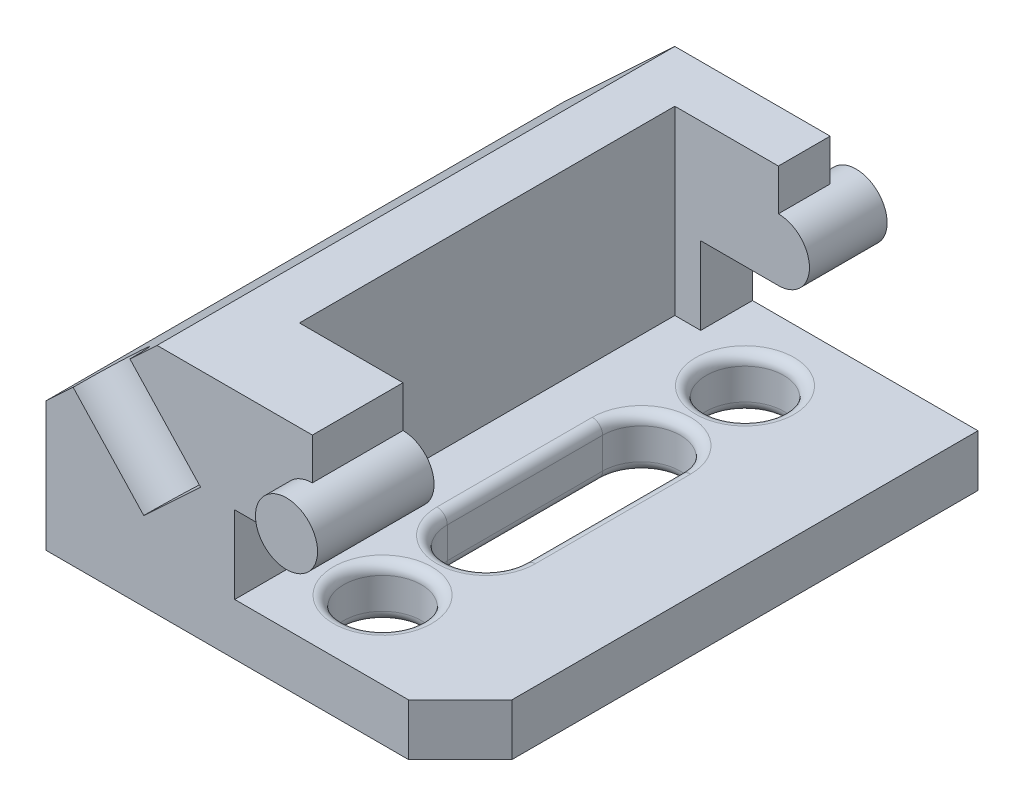
ISO-10303-21;
HEADER;
FILE_DESCRIPTION(('STEP AP214'),'2;1');
FILE_NAME('part.step','',(''),(''),'','','');
FILE_SCHEMA(('AUTOMOTIVE_DESIGN { 1 0 10303 214 1 1 1 1 }'));
ENDSEC;
DATA;
#1=APPLICATION_CONTEXT('core data for automotive mechanical design processes');
#2=APPLICATION_PROTOCOL_DEFINITION('international standard','automotive_design',2000,#1);
#3=PRODUCT_CONTEXT('',#1,'mechanical');
#4=PRODUCT('Part','Part','',(#3));
#5=PRODUCT_RELATED_PRODUCT_CATEGORY('part','',(#4));
#6=PRODUCT_DEFINITION_FORMATION('','',#4);
#7=PRODUCT_DEFINITION_CONTEXT('part definition',#1,'design');
#8=PRODUCT_DEFINITION('design','',#6,#7);
#9=PRODUCT_DEFINITION_SHAPE('','',#8);
#10=(LENGTH_UNIT() NAMED_UNIT(*) SI_UNIT(.MILLI.,.METRE.));
#11=(NAMED_UNIT(*) PLANE_ANGLE_UNIT() SI_UNIT($,.RADIAN.));
#12=(NAMED_UNIT(*) SI_UNIT($,.STERADIAN.) SOLID_ANGLE_UNIT());
#13=UNCERTAINTY_MEASURE_WITH_UNIT(LENGTH_MEASURE(1.E-05),#10,'distance_accuracy_value','');
#14=(GEOMETRIC_REPRESENTATION_CONTEXT(3) GLOBAL_UNCERTAINTY_ASSIGNED_CONTEXT((#13)) GLOBAL_UNIT_ASSIGNED_CONTEXT((#10,
#11,#12)) REPRESENTATION_CONTEXT('',''));
#15=CARTESIAN_POINT('',(0.,0.,0.));
#16=DIRECTION('',(0.,0.,1.));
#17=DIRECTION('',(1.,0.,0.));
#18=AXIS2_PLACEMENT_3D('',#15,#16,#17);
#19=CARTESIAN_POINT('',(36.4473742004937,9.99999999999999,100.));
#20=DIRECTION('',(-1.,0.,0.));
#21=DIRECTION('',(0.,0.,1.));
#22=AXIS2_PLACEMENT_3D('',#19,#20,#21);
#23=PLANE('',#22);
#24=DIRECTION('',(0.,0.,-1.));
#25=VECTOR('',#24,1.);
#26=CARTESIAN_POINT('',(36.4473742004937,9.99999999999999,100.));
#27=LINE('',#26,#25);
#28=CARTESIAN_POINT('',(36.4473742004937,9.99999999999999,100.));
#29=VERTEX_POINT('',#28);
#30=CARTESIAN_POINT('',(36.4473742004937,9.99999999999998,82.5));
#31=VERTEX_POINT('',#30);
#32=EDGE_CURVE('E299',#29,#31,#27,.T.);
#33=ORIENTED_EDGE('',*,*,#32,.T.);
#34=DIRECTION('',(0.,1.,0.));
#35=VECTOR('',#34,1.);
#36=CARTESIAN_POINT('',(36.4473742004937,9.99999999999999,82.5));
#37=LINE('',#36,#35);
#38=CARTESIAN_POINT('',(36.4473742004937,25.,82.5));
#39=VERTEX_POINT('',#38);
#40=EDGE_CURVE('E477',#31,#39,#37,.T.);
#41=ORIENTED_EDGE('',*,*,#40,.T.);
#42=DIRECTION('',(0.,0.,-1.));
#43=VECTOR('',#42,1.);
#44=CARTESIAN_POINT('',(36.4473742004937,25.,100.));
#45=LINE('',#44,#43);
#46=CARTESIAN_POINT('',(36.4473742004937,25.,100.));
#47=VERTEX_POINT('',#46);
#48=EDGE_CURVE('E295',#47,#39,#45,.T.);
#49=ORIENTED_EDGE('',*,*,#48,.F.);
#50=DIRECTION('',(0.,1.,0.));
#51=VECTOR('',#50,1.);
#52=CARTESIAN_POINT('',(36.4473742004937,9.99999999999999,100.));
#53=LINE('',#52,#51);
#54=EDGE_CURVE('E494',#29,#47,#53,.T.);
#55=ORIENTED_EDGE('',*,*,#54,.F.);
#56=EDGE_LOOP('',(#33,#41,#49,#55));
#57=FACE_BOUND('',#56,.T.);
#58=ADVANCED_FACE('F39',(#57),#23,.F.);
#59=CARTESIAN_POINT('',(36.4473742004937,25.,100.));
#60=DIRECTION('',(0.,1.,0.));
#61=DIRECTION('',(0.,0.,1.));
#62=AXIS2_PLACEMENT_3D('',#59,#60,#61);
#63=PLANE('',#62);
#64=ORIENTED_EDGE('',*,*,#48,.T.);
#65=DIRECTION('',(1.,0.,0.));
#66=VECTOR('',#65,1.);
#67=CARTESIAN_POINT('',(36.4473742004937,25.,82.5));
#68=LINE('',#67,#66);
#69=CARTESIAN_POINT('',(51.4473742004937,25.,82.5));
#70=VERTEX_POINT('',#69);
#71=EDGE_CURVE('E474',#39,#70,#68,.T.);
#72=ORIENTED_EDGE('',*,*,#71,.T.);
#73=DIRECTION('',(0.,0.,-1.));
#74=VECTOR('',#73,1.);
#75=CARTESIAN_POINT('',(51.4473742004937,25.,100.));
#76=LINE('',#75,#74);
#77=CARTESIAN_POINT('',(51.4473742004937,25.,100.));
#78=VERTEX_POINT('',#77);
#79=EDGE_CURVE('E291',#78,#70,#76,.T.);
#80=ORIENTED_EDGE('',*,*,#79,.F.);
#81=DIRECTION('',(1.,0.,0.));
#82=VECTOR('',#81,1.);
#83=CARTESIAN_POINT('',(36.4473742004937,25.,100.));
#84=LINE('',#83,#82);
#85=EDGE_CURVE('E496',#47,#78,#84,.T.);
#86=ORIENTED_EDGE('',*,*,#85,.F.);
#87=EDGE_LOOP('',(#64,#72,#80,#86));
#88=FACE_BOUND('',#87,.T.);
#89=ADVANCED_FACE('F566',(#88),#63,.F.);
#90=CARTESIAN_POINT('',(51.4473742004937,31.,100.));
#91=DIRECTION('',(0.,0.,-1.));
#92=DIRECTION('',(-1.,0.,0.));
#93=AXIS2_PLACEMENT_3D('',#90,#91,#92);
#94=CYLINDRICAL_SURFACE('',#93,6.);
#95=CARTESIAN_POINT('',(51.4473742004937,31.,105.));
#96=DIRECTION('',(0.,0.,1.));
#97=DIRECTION('',(1.,0.,0.));
#98=AXIS2_PLACEMENT_3D('',#95,#96,#97);
#99=CIRCLE('',#98,5.99999999999999);
#100=CARTESIAN_POINT('',(57.4473742004937,31.,105.));
#101=VERTEX_POINT('',#100);
#102=EDGE_CURVE('E480',#101,#101,#99,.T.);
#103=ORIENTED_EDGE('',*,*,#102,.F.);
#104=EDGE_LOOP('',(#103));
#105=FACE_BOUND('',#104,.T.);
#106=CARTESIAN_POINT('',(51.4473742004937,31.,82.5));
#107=DIRECTION('',(0.,0.,1.));
#108=DIRECTION('',(1.,0.,0.));
#109=AXIS2_PLACEMENT_3D('',#106,#107,#108);
#110=CIRCLE('',#109,6.);
#111=CARTESIAN_POINT('',(51.4473742004937,37.,82.5));
#112=VERTEX_POINT('',#111);
#113=EDGE_CURVE('E472',#70,#112,#110,.T.);
#114=ORIENTED_EDGE('',*,*,#113,.T.);
#115=DIRECTION('',(0.,0.,-1.));
#116=VECTOR('',#115,1.);
#117=CARTESIAN_POINT('',(51.4473742004937,37.,100.));
#118=LINE('',#117,#116);
#119=CARTESIAN_POINT('',(51.4473742004937,37.,100.));
#120=VERTEX_POINT('',#119);
#121=EDGE_CURVE('E287',#120,#112,#118,.T.);
#122=ORIENTED_EDGE('',*,*,#121,.F.);
#123=CARTESIAN_POINT('',(51.4473742004937,31.,100.));
#124=DIRECTION('',(0.,0.,1.));
#125=DIRECTION('',(1.,0.,0.));
#126=AXIS2_PLACEMENT_3D('',#123,#124,#125);
#127=CIRCLE('',#126,5.99999999999999);
#128=EDGE_CURVE('E255',#120,#78,#127,.T.);
#129=ORIENTED_EDGE('',*,*,#128,.T.);
#130=ORIENTED_EDGE('',*,*,#79,.T.);
#131=EDGE_LOOP('',(#114,#122,#129,#130));
#132=FACE_BOUND('',#131,.T.);
#133=ADVANCED_FACE('F568',(#105,#132),#94,.T.);
#134=CARTESIAN_POINT('',(51.4473742004937,37.,100.));
#135=DIRECTION('',(-1.,0.,0.));
#136=DIRECTION('',(0.,0.,1.));
#137=AXIS2_PLACEMENT_3D('',#134,#135,#136);
#138=PLANE('',#137);
#139=ORIENTED_EDGE('',*,*,#121,.T.);
#140=DIRECTION('',(0.,1.,0.));
#141=VECTOR('',#140,1.);
#142=CARTESIAN_POINT('',(51.4473742004937,37.,82.5));
#143=LINE('',#142,#141);
#144=CARTESIAN_POINT('',(51.4473742004937,45.,82.5));
#145=VERTEX_POINT('',#144);
#146=EDGE_CURVE('E469',#112,#145,#143,.T.);
#147=ORIENTED_EDGE('',*,*,#146,.T.);
#148=DIRECTION('',(0.,0.,-1.));
#149=VECTOR('',#148,1.);
#150=CARTESIAN_POINT('',(51.4473742004937,45.,100.));
#151=LINE('',#150,#149);
#152=CARTESIAN_POINT('',(51.4473742004937,45.,100.));
#153=VERTEX_POINT('',#152);
#154=EDGE_CURVE('E283',#153,#145,#151,.T.);
#155=ORIENTED_EDGE('',*,*,#154,.F.);
#156=DIRECTION('',(0.,1.,0.));
#157=VECTOR('',#156,1.);
#158=CARTESIAN_POINT('',(51.4473742004937,37.,100.));
#159=LINE('',#158,#157);
#160=EDGE_CURVE('E247',#120,#153,#159,.T.);
#161=ORIENTED_EDGE('',*,*,#160,.F.);
#162=EDGE_LOOP('',(#139,#147,#155,#161));
#163=FACE_BOUND('',#162,.T.);
#164=ADVANCED_FACE('F503',(#163),#138,.F.);
#165=CARTESIAN_POINT('',(0.,25.,100.));
#166=DIRECTION('',(1.,0.,0.));
#167=DIRECTION('',(0.,1.,0.));
#168=AXIS2_PLACEMENT_3D('',#165,#166,#167);
#169=PLANE('',#168);
#170=DIRECTION('',(0.,-1.,0.));
#171=VECTOR('',#170,1.);
#172=CARTESIAN_POINT('',(0.,25.,0.));
#173=LINE('',#172,#171);
#174=CARTESIAN_POINT('',(0.,25.,0.));
#175=VERTEX_POINT('',#174);
#176=CARTESIAN_POINT('',(0.,0.,0.));
#177=VERTEX_POINT('',#176);
#178=EDGE_CURVE('E251',#175,#177,#173,.T.);
#179=ORIENTED_EDGE('',*,*,#178,.T.);
#180=DIRECTION('',(0.,0.,-1.));
#181=VECTOR('',#180,1.);
#182=CARTESIAN_POINT('',(0.,0.,100.));
#183=LINE('',#182,#181);
#184=CARTESIAN_POINT('',(0.,0.,100.));
#185=VERTEX_POINT('',#184);
#186=EDGE_CURVE('E306',#185,#177,#183,.T.);
#187=ORIENTED_EDGE('',*,*,#186,.F.);
#188=DIRECTION('',(0.,-1.,0.));
#189=VECTOR('',#188,1.);
#190=CARTESIAN_POINT('',(0.,25.,100.));
#191=LINE('',#190,#189);
#192=CARTESIAN_POINT('',(0.,25.,100.));
#193=VERTEX_POINT('',#192);
#194=EDGE_CURVE('E277',#193,#185,#191,.T.);
#195=ORIENTED_EDGE('',*,*,#194,.F.);
#196=DIRECTION('',(0.,0.,-1.));
#197=VECTOR('',#196,1.);
#198=CARTESIAN_POINT('',(0.,25.,100.));
#199=LINE('',#198,#197);
#200=EDGE_CURVE('E242',#193,#175,#199,.T.);
#201=ORIENTED_EDGE('',*,*,#200,.T.);
#202=EDGE_LOOP('',(#179,#187,#195,#201));
#203=FACE_BOUND('',#202,.T.);
#204=ADVANCED_FACE('F517',(#203),#169,.F.);
#205=CARTESIAN_POINT('',(0.,0.,100.));
#206=DIRECTION('',(0.,1.,0.));
#207=DIRECTION('',(0.,0.,1.));
#208=AXIS2_PLACEMENT_3D('',#205,#206,#207);
#209=PLANE('',#208);
#210=DIRECTION('',(0.,0.,-1.));
#211=VECTOR('',#210,1.);
#212=CARTESIAN_POINT('',(59.5,0.,100.));
#213=LINE('',#212,#211);
#214=CARTESIAN_POINT('',(59.5,0.,65.));
#215=VERTEX_POINT('',#214);
#216=CARTESIAN_POINT('',(59.5,0.,35.));
#217=VERTEX_POINT('',#216);
#218=EDGE_CURVE('E334',#215,#217,#213,.T.);
#219=ORIENTED_EDGE('',*,*,#218,.T.);
#220=CARTESIAN_POINT('',(50.,0.,35.));
#221=DIRECTION('',(0.,1.,0.));
#222=DIRECTION('',(0.,0.,1.));
#223=AXIS2_PLACEMENT_3D('',#220,#221,#222);
#224=CIRCLE('',#223,9.5);
#225=CARTESIAN_POINT('',(40.5,0.,35.));
#226=VERTEX_POINT('',#225);
#227=EDGE_CURVE('E336',#217,#226,#224,.T.);
#228=ORIENTED_EDGE('',*,*,#227,.T.);
#229=DIRECTION('',(0.,0.,1.));
#230=VECTOR('',#229,1.);
#231=CARTESIAN_POINT('',(40.5,0.,100.));
#232=LINE('',#231,#230);
#233=CARTESIAN_POINT('',(40.5,0.,65.));
#234=VERTEX_POINT('',#233);
#235=EDGE_CURVE('E330',#226,#234,#232,.T.);
#236=ORIENTED_EDGE('',*,*,#235,.T.);
#237=CARTESIAN_POINT('',(50.,0.,65.));
#238=DIRECTION('',(0.,1.,0.));
#239=DIRECTION('',(0.,0.,1.));
#240=AXIS2_PLACEMENT_3D('',#237,#238,#239);
#241=CIRCLE('',#240,9.5);
#242=EDGE_CURVE('E332',#234,#215,#241,.T.);
#243=ORIENTED_EDGE('',*,*,#242,.T.);
#244=EDGE_LOOP('',(#219,#228,#236,#243));
#245=FACE_BOUND('',#244,.T.);
#246=CARTESIAN_POINT('',(50.,0.,85.));
#247=DIRECTION('',(0.,1.,0.));
#248=DIRECTION('',(0.,0.,1.));
#249=AXIS2_PLACEMENT_3D('',#246,#247,#248);
#250=CIRCLE('',#249,9.50000000000002);
#251=CARTESIAN_POINT('',(50.,0.,94.5));
#252=VERTEX_POINT('',#251);
#253=EDGE_CURVE('E327',#252,#252,#250,.T.);
#254=ORIENTED_EDGE('',*,*,#253,.T.);
#255=EDGE_LOOP('',(#254));
#256=FACE_BOUND('',#255,.T.);
#257=CARTESIAN_POINT('',(50.,0.,15.));
#258=DIRECTION('',(0.,1.,0.));
#259=DIRECTION('',(0.,0.,1.));
#260=AXIS2_PLACEMENT_3D('',#257,#258,#259);
#261=CIRCLE('',#260,9.5);
#262=CARTESIAN_POINT('',(50.,0.,24.5));
#263=VERTEX_POINT('',#262);
#264=EDGE_CURVE('E324',#263,#263,#261,.T.);
#265=ORIENTED_EDGE('',*,*,#264,.T.);
#266=EDGE_LOOP('',(#265));
#267=FACE_BOUND('',#266,.T.);
#268=DIRECTION('',(0.,0.,-1.));
#269=VECTOR('',#268,1.);
#270=CARTESIAN_POINT('',(80.,0.,100.));
#271=LINE('',#270,#269);
#272=CARTESIAN_POINT('',(80.,0.,90.));
#273=VERTEX_POINT('',#272);
#274=CARTESIAN_POINT('',(80.,0.,0.));
#275=VERTEX_POINT('',#274);
#276=EDGE_CURVE('E304',#273,#275,#271,.T.);
#277=ORIENTED_EDGE('',*,*,#276,.F.);
#278=DIRECTION('',(-0.707106781186545,0.,0.707106781186549));
#279=VECTOR('',#278,1.);
#280=CARTESIAN_POINT('',(70.,0.,100.));
#281=LINE('',#280,#279);
#282=CARTESIAN_POINT('',(70.,0.,100.));
#283=VERTEX_POINT('',#282);
#284=EDGE_CURVE('E316',#273,#283,#281,.T.);
#285=ORIENTED_EDGE('',*,*,#284,.T.);
#286=DIRECTION('',(1.,0.,0.));
#287=VECTOR('',#286,1.);
#288=CARTESIAN_POINT('',(0.,0.,100.));
#289=LINE('',#288,#287);
#290=EDGE_CURVE('E489',#185,#283,#289,.T.);
#291=ORIENTED_EDGE('',*,*,#290,.F.);
#292=ORIENTED_EDGE('',*,*,#186,.T.);
#293=DIRECTION('',(1.,0.,0.));
#294=VECTOR('',#293,1.);
#295=CARTESIAN_POINT('',(0.,0.,0.));
#296=LINE('',#295,#294);
#297=EDGE_CURVE('E254',#177,#275,#296,.T.);
#298=ORIENTED_EDGE('',*,*,#297,.T.);
#299=EDGE_LOOP('',(#277,#285,#291,#292,#298));
#300=FACE_BOUND('',#299,.T.);
#301=ADVANCED_FACE('F596',(#245,#256,#267,#300),#209,.F.);
#302=CARTESIAN_POINT('',(80.,0.,100.));
#303=DIRECTION('',(-1.,0.,0.));
#304=DIRECTION('',(0.,0.,1.));
#305=AXIS2_PLACEMENT_3D('',#302,#303,#304);
#306=PLANE('',#305);
#307=DIRECTION('',(0.,0.,-1.));
#308=VECTOR('',#307,1.);
#309=CARTESIAN_POINT('',(80.,10.,100.));
#310=LINE('',#309,#308);
#311=CARTESIAN_POINT('',(80.,10.,90.));
#312=VERTEX_POINT('',#311);
#313=CARTESIAN_POINT('',(80.,10.,0.));
#314=VERTEX_POINT('',#313);
#315=EDGE_CURVE('E302',#312,#314,#310,.T.);
#316=ORIENTED_EDGE('',*,*,#315,.F.);
#317=DIRECTION('',(0.,-1.,0.));
#318=VECTOR('',#317,1.);
#319=CARTESIAN_POINT('',(80.,0.,90.));
#320=LINE('',#319,#318);
#321=EDGE_CURVE('E314',#312,#273,#320,.T.);
#322=ORIENTED_EDGE('',*,*,#321,.T.);
#323=ORIENTED_EDGE('',*,*,#276,.T.);
#324=DIRECTION('',(0.,1.,0.));
#325=VECTOR('',#324,1.);
#326=CARTESIAN_POINT('',(80.,0.,0.));
#327=LINE('',#326,#325);
#328=EDGE_CURVE('E258',#275,#314,#327,.T.);
#329=ORIENTED_EDGE('',*,*,#328,.T.);
#330=EDGE_LOOP('',(#316,#322,#323,#329));
#331=FACE_BOUND('',#330,.T.);
#332=ADVANCED_FACE('F529',(#331),#306,.F.);
#333=CARTESIAN_POINT('',(80.,10.,100.));
#334=DIRECTION('',(0.,-1.,0.));
#335=DIRECTION('',(1.,0.,0.));
#336=AXIS2_PLACEMENT_3D('',#333,#334,#335);
#337=PLANE('',#336);
#338=DIRECTION('',(0.,0.,1.));
#339=VECTOR('',#338,1.);
#340=CARTESIAN_POINT('',(40.5,9.99999999999999,100.));
#341=LINE('',#340,#339);
#342=CARTESIAN_POINT('',(40.5,9.99999999999999,65.));
#343=VERTEX_POINT('',#342);
#344=CARTESIAN_POINT('',(40.5,9.99999999999999,35.));
#345=VERTEX_POINT('',#344);
#346=EDGE_CURVE('E351',#343,#345,#341,.F.);
#347=ORIENTED_EDGE('',*,*,#346,.T.);
#348=CARTESIAN_POINT('',(50.,9.99999999999999,35.));
#349=DIRECTION('',(0.,-1.,0.));
#350=DIRECTION('',(1.,0.,0.));
#351=AXIS2_PLACEMENT_3D('',#348,#349,#350);
#352=CIRCLE('',#351,9.5);
#353=CARTESIAN_POINT('',(59.5,10.,35.));
#354=VERTEX_POINT('',#353);
#355=EDGE_CURVE('E357',#345,#354,#352,.T.);
#356=ORIENTED_EDGE('',*,*,#355,.T.);
#357=DIRECTION('',(0.,0.,-1.));
#358=VECTOR('',#357,1.);
#359=CARTESIAN_POINT('',(59.5,10.,100.));
#360=LINE('',#359,#358);
#361=CARTESIAN_POINT('',(59.5,10.,65.));
#362=VERTEX_POINT('',#361);
#363=EDGE_CURVE('E355',#354,#362,#360,.F.);
#364=ORIENTED_EDGE('',*,*,#363,.T.);
#365=CARTESIAN_POINT('',(50.,9.99999999999999,65.));
#366=DIRECTION('',(0.,-1.,0.));
#367=DIRECTION('',(1.,0.,0.));
#368=AXIS2_PLACEMENT_3D('',#365,#366,#367);
#369=CIRCLE('',#368,9.5);
#370=EDGE_CURVE('E353',#362,#343,#369,.T.);
#371=ORIENTED_EDGE('',*,*,#370,.T.);
#372=EDGE_LOOP('',(#347,#356,#364,#371));
#373=FACE_BOUND('',#372,.T.);
#374=CARTESIAN_POINT('',(50.,9.99999999999999,85.));
#375=DIRECTION('',(0.,-1.,0.));
#376=DIRECTION('',(1.,0.,0.));
#377=AXIS2_PLACEMENT_3D('',#374,#375,#376);
#378=CIRCLE('',#377,9.50000000000002);
#379=CARTESIAN_POINT('',(59.5,10.,85.));
#380=VERTEX_POINT('',#379);
#381=EDGE_CURVE('E348',#380,#380,#378,.T.);
#382=ORIENTED_EDGE('',*,*,#381,.T.);
#383=EDGE_LOOP('',(#382));
#384=FACE_BOUND('',#383,.T.);
#385=CARTESIAN_POINT('',(50.,9.99999999999999,15.));
#386=DIRECTION('',(0.,-1.,0.));
#387=DIRECTION('',(1.,0.,0.));
#388=AXIS2_PLACEMENT_3D('',#385,#386,#387);
#389=CIRCLE('',#388,9.5);
#390=CARTESIAN_POINT('',(59.5,10.,15.));
#391=VERTEX_POINT('',#390);
#392=EDGE_CURVE('E345',#391,#391,#389,.T.);
#393=ORIENTED_EDGE('',*,*,#392,.T.);
#394=EDGE_LOOP('',(#393));
#395=FACE_BOUND('',#394,.T.);
#396=DIRECTION('',(1.,0.,0.));
#397=VECTOR('',#396,1.);
#398=CARTESIAN_POINT('',(31.4473742004937,9.99999999999998,82.5));
#399=LINE('',#398,#397);
#400=CARTESIAN_POINT('',(31.4473742004937,9.99999999999998,82.5));
#401=VERTEX_POINT('',#400);
#402=EDGE_CURVE('E443',#401,#31,#399,.T.);
#403=ORIENTED_EDGE('',*,*,#402,.T.);
#404=ORIENTED_EDGE('',*,*,#32,.F.);
#405=DIRECTION('',(-1.,0.,0.));
#406=VECTOR('',#405,1.);
#407=CARTESIAN_POINT('',(80.,10.,100.));
#408=LINE('',#407,#406);
#409=CARTESIAN_POINT('',(70.,10.,100.));
#410=VERTEX_POINT('',#409);
#411=EDGE_CURVE('E492',#410,#29,#408,.T.);
#412=ORIENTED_EDGE('',*,*,#411,.F.);
#413=DIRECTION('',(0.707106781186545,0.,-0.707106781186549));
#414=VECTOR('',#413,1.);
#415=CARTESIAN_POINT('',(70.,10.,100.));
#416=LINE('',#415,#414);
#417=EDGE_CURVE('E312',#410,#312,#416,.T.);
#418=ORIENTED_EDGE('',*,*,#417,.T.);
#419=ORIENTED_EDGE('',*,*,#315,.T.);
#420=DIRECTION('',(-1.,0.,0.));
#421=VECTOR('',#420,1.);
#422=CARTESIAN_POINT('',(80.,10.,0.));
#423=LINE('',#422,#421);
#424=CARTESIAN_POINT('',(36.4473742004937,9.99999999999999,0.));
#425=VERTEX_POINT('',#424);
#426=EDGE_CURVE('E261',#314,#425,#423,.T.);
#427=ORIENTED_EDGE('',*,*,#426,.T.);
#428=CARTESIAN_POINT('',(36.4473742004937,9.99999999999997,10.));
#429=VERTEX_POINT('',#428);
#430=EDGE_CURVE('E298',#429,#425,#27,.T.);
#431=ORIENTED_EDGE('',*,*,#430,.F.);
#432=DIRECTION('',(-1.,0.,0.));
#433=VECTOR('',#432,1.);
#434=CARTESIAN_POINT('',(31.4473742004937,9.99999999999997,10.));
#435=LINE('',#434,#433);
#436=CARTESIAN_POINT('',(31.4473742004937,9.99999999999997,10.));
#437=VERTEX_POINT('',#436);
#438=EDGE_CURVE('E449',#429,#437,#435,.T.);
#439=ORIENTED_EDGE('',*,*,#438,.T.);
#440=DIRECTION('',(0.,0.,1.));
#441=VECTOR('',#440,1.);
#442=CARTESIAN_POINT('',(31.4473742004937,9.99999999999997,10.));
#443=LINE('',#442,#441);
#444=EDGE_CURVE('E450',#437,#401,#443,.T.);
#445=ORIENTED_EDGE('',*,*,#444,.T.);
#446=EDGE_LOOP('',(#403,#404,#412,#418,#419,#427,#431,#439,#445));
#447=FACE_BOUND('',#446,.T.);
#448=ADVANCED_FACE('F417',(#373,#384,#395,#447),#337,.F.);
#449=CARTESIAN_POINT('',(36.4473742004937,25.,10.));
#450=VERTEX_POINT('',#449);
#451=CARTESIAN_POINT('',(36.4473742004937,25.,0.));
#452=VERTEX_POINT('',#451);
#453=EDGE_CURVE('E294',#450,#452,#45,.T.);
#454=ORIENTED_EDGE('',*,*,#453,.F.);
#455=DIRECTION('',(0.,-1.,0.));
#456=VECTOR('',#455,1.);
#457=CARTESIAN_POINT('',(36.4473742004937,9.99999999999999,9.99999999999999));
#458=LINE('',#457,#456);
#459=EDGE_CURVE('E466',#450,#429,#458,.T.);
#460=ORIENTED_EDGE('',*,*,#459,.T.);
#461=ORIENTED_EDGE('',*,*,#430,.T.);
#462=DIRECTION('',(0.,1.,0.));
#463=VECTOR('',#462,1.);
#464=CARTESIAN_POINT('',(36.4473742004937,9.99999999999999,0.));
#465=LINE('',#464,#463);
#466=EDGE_CURVE('E264',#425,#452,#465,.T.);
#467=ORIENTED_EDGE('',*,*,#466,.T.);
#468=EDGE_LOOP('',(#454,#460,#461,#467));
#469=FACE_BOUND('',#468,.T.);
#470=ADVANCED_FACE('F538',(#469),#23,.F.);
#471=CARTESIAN_POINT('',(51.4473742004937,25.,10.));
#472=VERTEX_POINT('',#471);
#473=CARTESIAN_POINT('',(51.4473742004937,25.,0.));
#474=VERTEX_POINT('',#473);
#475=EDGE_CURVE('E290',#472,#474,#76,.T.);
#476=ORIENTED_EDGE('',*,*,#475,.F.);
#477=DIRECTION('',(-1.,0.,0.));
#478=VECTOR('',#477,1.);
#479=CARTESIAN_POINT('',(36.4473742004937,25.,10.));
#480=LINE('',#479,#478);
#481=EDGE_CURVE('E463',#472,#450,#480,.T.);
#482=ORIENTED_EDGE('',*,*,#481,.T.);
#483=ORIENTED_EDGE('',*,*,#453,.T.);
#484=DIRECTION('',(1.,0.,0.));
#485=VECTOR('',#484,1.);
#486=CARTESIAN_POINT('',(36.4473742004937,25.,0.));
#487=LINE('',#486,#485);
#488=EDGE_CURVE('E267',#452,#474,#487,.T.);
#489=ORIENTED_EDGE('',*,*,#488,.T.);
#490=EDGE_LOOP('',(#476,#482,#483,#489));
#491=FACE_BOUND('',#490,.T.);
#492=ADVANCED_FACE('F545',(#491),#63,.F.);
#493=CARTESIAN_POINT('',(51.4473742004937,31.,10.));
#494=DIRECTION('',(0.,0.,-1.));
#495=DIRECTION('',(-1.,0.,0.));
#496=AXIS2_PLACEMENT_3D('',#493,#494,#495);
#497=CIRCLE('',#496,6.);
#498=CARTESIAN_POINT('',(51.4473742004937,37.,10.));
#499=VERTEX_POINT('',#498);
#500=EDGE_CURVE('E461',#499,#472,#497,.T.);
#501=ORIENTED_EDGE('',*,*,#500,.T.);
#502=ORIENTED_EDGE('',*,*,#475,.T.);
#503=CARTESIAN_POINT('',(51.4473742004937,31.,0.));
#504=DIRECTION('',(0.,0.,1.));
#505=DIRECTION('',(1.,0.,0.));
#506=AXIS2_PLACEMENT_3D('',#503,#504,#505);
#507=CIRCLE('',#506,5.99999999999999);
#508=CARTESIAN_POINT('',(51.4473742004937,37.,0.));
#509=VERTEX_POINT('',#508);
#510=EDGE_CURVE('E318',#509,#474,#507,.T.);
#511=ORIENTED_EDGE('',*,*,#510,.F.);
#512=EDGE_CURVE('E286',#499,#509,#118,.T.);
#513=ORIENTED_EDGE('',*,*,#512,.F.);
#514=EDGE_LOOP('',(#501,#502,#511,#513));
#515=FACE_BOUND('',#514,.T.);
#516=CARTESIAN_POINT('',(51.4473742004937,31.,-5.));
#517=DIRECTION('',(0.,0.,1.));
#518=DIRECTION('',(1.,0.,0.));
#519=AXIS2_PLACEMENT_3D('',#516,#517,#518);
#520=CIRCLE('',#519,5.99999999999999);
#521=CARTESIAN_POINT('',(57.4473742004937,31.,-5.));
#522=VERTEX_POINT('',#521);
#523=EDGE_CURVE('E483',#522,#522,#520,.T.);
#524=ORIENTED_EDGE('',*,*,#523,.T.);
#525=EDGE_LOOP('',(#524));
#526=FACE_BOUND('',#525,.T.);
#527=ADVANCED_FACE('F548',(#515,#526),#94,.T.);
#528=CARTESIAN_POINT('',(51.4473742004937,45.,10.));
#529=VERTEX_POINT('',#528);
#530=CARTESIAN_POINT('',(51.4473742004937,45.,0.));
#531=VERTEX_POINT('',#530);
#532=EDGE_CURVE('E282',#529,#531,#151,.T.);
#533=ORIENTED_EDGE('',*,*,#532,.F.);
#534=DIRECTION('',(0.,-1.,0.));
#535=VECTOR('',#534,1.);
#536=CARTESIAN_POINT('',(51.4473742004937,37.,10.));
#537=LINE('',#536,#535);
#538=EDGE_CURVE('E458',#529,#499,#537,.T.);
#539=ORIENTED_EDGE('',*,*,#538,.T.);
#540=ORIENTED_EDGE('',*,*,#512,.T.);
#541=DIRECTION('',(0.,1.,0.));
#542=VECTOR('',#541,1.);
#543=CARTESIAN_POINT('',(51.4473742004937,37.,0.));
#544=LINE('',#543,#542);
#545=EDGE_CURVE('E270',#509,#531,#544,.T.);
#546=ORIENTED_EDGE('',*,*,#545,.T.);
#547=EDGE_LOOP('',(#533,#539,#540,#546));
#548=FACE_BOUND('',#547,.T.);
#549=ADVANCED_FACE('F553',(#548),#138,.F.);
#550=CARTESIAN_POINT('',(51.4473742004937,45.,100.));
#551=DIRECTION('',(0.,-1.,0.));
#552=DIRECTION('',(1.,0.,0.));
#553=AXIS2_PLACEMENT_3D('',#550,#551,#552);
#554=PLANE('',#553);
#555=ORIENTED_EDGE('',*,*,#154,.T.);
#556=DIRECTION('',(1.,0.,0.));
#557=VECTOR('',#556,1.);
#558=CARTESIAN_POINT('',(31.4473742004937,45.,82.5));
#559=LINE('',#558,#557);
#560=CARTESIAN_POINT('',(31.4473742004937,45.,82.5));
#561=VERTEX_POINT('',#560);
#562=EDGE_CURVE('E441',#561,#145,#559,.T.);
#563=ORIENTED_EDGE('',*,*,#562,.F.);
#564=DIRECTION('',(0.,0.,1.));
#565=VECTOR('',#564,1.);
#566=CARTESIAN_POINT('',(31.4473742004937,45.,10.));
#567=LINE('',#566,#565);
#568=CARTESIAN_POINT('',(31.4473742004937,45.,9.99999999999999));
#569=VERTEX_POINT('',#568);
#570=EDGE_CURVE('E444',#569,#561,#567,.T.);
#571=ORIENTED_EDGE('',*,*,#570,.F.);
#572=DIRECTION('',(1.,0.,0.));
#573=VECTOR('',#572,1.);
#574=CARTESIAN_POINT('',(51.4473742004937,45.,9.99999999999999));
#575=LINE('',#574,#573);
#576=EDGE_CURVE('E321',#569,#529,#575,.T.);
#577=ORIENTED_EDGE('',*,*,#576,.T.);
#578=ORIENTED_EDGE('',*,*,#532,.T.);
#579=DIRECTION('',(-1.,0.,0.));
#580=VECTOR('',#579,1.);
#581=CARTESIAN_POINT('',(51.4473742004937,45.,0.));
#582=LINE('',#581,#580);
#583=CARTESIAN_POINT('',(21.4473742004937,45.,0.));
#584=VERTEX_POINT('',#583);
#585=EDGE_CURVE('E273',#531,#584,#582,.T.);
#586=ORIENTED_EDGE('',*,*,#585,.T.);
#587=DIRECTION('',(0.,0.,-1.));
#588=VECTOR('',#587,1.);
#589=CARTESIAN_POINT('',(21.4473742004937,45.,100.));
#590=LINE('',#589,#588);
#591=CARTESIAN_POINT('',(21.4473742004937,45.,100.));
#592=VERTEX_POINT('',#591);
#593=EDGE_CURVE('E279',#592,#584,#590,.T.);
#594=ORIENTED_EDGE('',*,*,#593,.F.);
#595=DIRECTION('',(-1.,0.,0.));
#596=VECTOR('',#595,1.);
#597=CARTESIAN_POINT('',(51.4473742004937,45.,100.));
#598=LINE('',#597,#596);
#599=EDGE_CURVE('E245',#153,#592,#598,.T.);
#600=ORIENTED_EDGE('',*,*,#599,.F.);
#601=EDGE_LOOP('',(#555,#563,#571,#577,#578,#586,#594,#600));
#602=FACE_BOUND('',#601,.T.);
#603=ADVANCED_FACE('F507',(#602),#554,.F.);
#604=CARTESIAN_POINT('',(21.4473742004937,45.,100.));
#605=DIRECTION('',(0.681998360062497,-0.731353701619172,0.));
#606=DIRECTION('',(0.731353701619172,0.681998360062497,0.));
#607=AXIS2_PLACEMENT_3D('',#604,#605,#606);
#608=PLANE('',#607);
#609=DIRECTION('',(-0.731353701619172,-0.681998360062497,0.));
#610=VECTOR('',#609,1.);
#611=CARTESIAN_POINT('',(21.4473742004937,45.,100.));
#612=LINE('',#611,#610);
#613=CARTESIAN_POINT('',(5.23853433810307,29.8850122995313,100.));
#614=VERTEX_POINT('',#613);
#615=EDGE_CURVE('E237',#614,#193,#612,.T.);
#616=ORIENTED_EDGE('',*,*,#615,.F.);
#617=CARTESIAN_POINT('',(10.7236871002469,35.,100.));
#618=DIRECTION('',(-0.681998360062497,0.731353701619172,0.));
#619=DIRECTION('',(-0.731353701619172,-0.681998360062497,0.));
#620=AXIS2_PLACEMENT_3D('',#617,#618,#619);
#621=CIRCLE('',#620,7.5);
#622=CARTESIAN_POINT('',(16.2088398623906,40.1149877004687,100.));
#623=VERTEX_POINT('',#622);
#624=EDGE_CURVE('E224',#623,#614,#621,.T.);
#625=ORIENTED_EDGE('',*,*,#624,.F.);
#626=EDGE_CURVE('E244',#592,#623,#612,.T.);
#627=ORIENTED_EDGE('',*,*,#626,.F.);
#628=ORIENTED_EDGE('',*,*,#593,.T.);
#629=DIRECTION('',(-0.731353701619172,-0.681998360062497,0.));
#630=VECTOR('',#629,1.);
#631=CARTESIAN_POINT('',(21.4473742004937,45.,0.));
#632=LINE('',#631,#630);
#633=EDGE_CURVE('E275',#584,#175,#632,.T.);
#634=ORIENTED_EDGE('',*,*,#633,.T.);
#635=ORIENTED_EDGE('',*,*,#200,.F.);
#636=EDGE_LOOP('',(#616,#625,#627,#628,#634,#635));
#637=FACE_BOUND('',#636,.T.);
#638=ADVANCED_FACE('F240',(#637),#608,.F.);
#639=CARTESIAN_POINT('',(51.4473742004937,31.,100.));
#640=DIRECTION('',(0.,0.,1.));
#641=DIRECTION('',(1.,0.,0.));
#642=AXIS2_PLACEMENT_3D('',#639,#640,#641);
#643=PLANE('',#642);
#644=DIRECTION('',(-0.681998360062497,0.731353701619172,0.));
#645=VECTOR('',#644,1.);
#646=CARTESIAN_POINT('',(29.8488070636406,25.4879136680853,100.));
#647=LINE('',#646,#645);
#648=CARTESIAN_POINT('',(29.8488070636406,25.4879136680853,100.));
#649=VERTEX_POINT('',#648);
#650=EDGE_CURVE('E11',#649,#623,#647,.T.);
#651=ORIENTED_EDGE('',*,*,#650,.F.);
#652=DIRECTION('',(-0.731353701619172,-0.681998360062497,0.));
#653=VECTOR('',#652,1.);
#654=CARTESIAN_POINT('',(44.1507401560868,38.8246820377228,100.));
#655=LINE('',#654,#653);
#656=CARTESIAN_POINT('',(18.878501539353,15.2579382671478,100.));
#657=VERTEX_POINT('',#656);
#658=EDGE_CURVE('E239',#649,#657,#655,.T.);
#659=ORIENTED_EDGE('',*,*,#658,.T.);
#660=DIRECTION('',(-0.681998360062497,0.731353701619172,0.));
#661=VECTOR('',#660,1.);
#662=CARTESIAN_POINT('',(18.878501539353,15.2579382671478,100.));
#663=LINE('',#662,#661);
#664=EDGE_CURVE('E47',#614,#657,#663,.F.);
#665=ORIENTED_EDGE('',*,*,#664,.F.);
#666=ORIENTED_EDGE('',*,*,#615,.T.);
#667=ORIENTED_EDGE('',*,*,#194,.T.);
#668=ORIENTED_EDGE('',*,*,#290,.T.);
#669=DIRECTION('',(0.,1.,0.));
#670=VECTOR('',#669,1.);
#671=CARTESIAN_POINT('',(70.,10.,100.));
#672=LINE('',#671,#670);
#673=EDGE_CURVE('E309',#283,#410,#672,.T.);
#674=ORIENTED_EDGE('',*,*,#673,.T.);
#675=ORIENTED_EDGE('',*,*,#411,.T.);
#676=ORIENTED_EDGE('',*,*,#54,.T.);
#677=ORIENTED_EDGE('',*,*,#85,.T.);
#678=ORIENTED_EDGE('',*,*,#128,.F.);
#679=ORIENTED_EDGE('',*,*,#160,.T.);
#680=ORIENTED_EDGE('',*,*,#599,.T.);
#681=ORIENTED_EDGE('',*,*,#626,.T.);
#682=EDGE_LOOP('',(#651,#659,#665,#666,#667,#668,#674,#675,#676,#677,#678,#679,#680,#681));
#683=FACE_BOUND('',#682,.T.);
#684=ADVANCED_FACE('F235',(#683),#643,.T.);
#685=CARTESIAN_POINT('',(51.4473742004937,31.,0.));
#686=DIRECTION('',(0.,0.,1.));
#687=DIRECTION('',(1.,0.,0.));
#688=AXIS2_PLACEMENT_3D('',#685,#686,#687);
#689=PLANE('',#688);
#690=ORIENTED_EDGE('',*,*,#545,.F.);
#691=ORIENTED_EDGE('',*,*,#510,.T.);
#692=ORIENTED_EDGE('',*,*,#488,.F.);
#693=ORIENTED_EDGE('',*,*,#466,.F.);
#694=ORIENTED_EDGE('',*,*,#426,.F.);
#695=ORIENTED_EDGE('',*,*,#328,.F.);
#696=ORIENTED_EDGE('',*,*,#297,.F.);
#697=ORIENTED_EDGE('',*,*,#178,.F.);
#698=ORIENTED_EDGE('',*,*,#633,.F.);
#699=ORIENTED_EDGE('',*,*,#585,.F.);
#700=EDGE_LOOP('',(#690,#691,#692,#693,#694,#695,#696,#697,#698,#699));
#701=FACE_BOUND('',#700,.T.);
#702=ADVANCED_FACE('F513',(#701),#689,.F.);
#703=CARTESIAN_POINT('',(70.,31.,100.));
#704=DIRECTION('',(0.707106781186549,0.,0.707106781186545));
#705=DIRECTION('',(0.,-1.,0.));
#706=AXIS2_PLACEMENT_3D('',#703,#704,#705);
#707=PLANE('',#706);
#708=ORIENTED_EDGE('',*,*,#284,.F.);
#709=ORIENTED_EDGE('',*,*,#321,.F.);
#710=ORIENTED_EDGE('',*,*,#417,.F.);
#711=ORIENTED_EDGE('',*,*,#673,.F.);
#712=EDGE_LOOP('',(#708,#709,#710,#711));
#713=FACE_BOUND('',#712,.T.);
#714=ADVANCED_FACE('F523',(#713),#707,.T.);
#715=CARTESIAN_POINT('',(51.4473742004937,31.,-5.));
#716=DIRECTION('',(0.,0.,1.));
#717=DIRECTION('',(1.,0.,0.));
#718=AXIS2_PLACEMENT_3D('',#715,#716,#717);
#719=PLANE('',#718);
#720=ORIENTED_EDGE('',*,*,#523,.F.);
#721=EDGE_LOOP('',(#720));
#722=FACE_BOUND('',#721,.T.);
#723=ADVANCED_FACE('F578',(#722),#719,.F.);
#724=CARTESIAN_POINT('',(51.4473742004937,31.,105.));
#725=DIRECTION('',(0.,0.,1.));
#726=DIRECTION('',(1.,0.,0.));
#727=AXIS2_PLACEMENT_3D('',#724,#725,#726);
#728=PLANE('',#727);
#729=ORIENTED_EDGE('',*,*,#102,.T.);
#730=EDGE_LOOP('',(#729));
#731=FACE_BOUND('',#730,.T.);
#732=ADVANCED_FACE('F571',(#731),#728,.T.);
#733=CARTESIAN_POINT('',(31.4473742004937,-67.0211010048545,82.5));
#734=DIRECTION('',(0.,0.,1.));
#735=DIRECTION('',(1.,0.,0.));
#736=AXIS2_PLACEMENT_3D('',#733,#734,#735);
#737=PLANE('',#736);
#738=ORIENTED_EDGE('',*,*,#402,.F.);
#739=DIRECTION('',(0.,1.,0.));
#740=VECTOR('',#739,1.);
#741=CARTESIAN_POINT('',(31.4473742004937,-67.0211010048545,82.5));
#742=LINE('',#741,#740);
#743=EDGE_CURVE('E453',#401,#561,#742,.T.);
#744=ORIENTED_EDGE('',*,*,#743,.T.);
#745=ORIENTED_EDGE('',*,*,#562,.T.);
#746=ORIENTED_EDGE('',*,*,#146,.F.);
#747=ORIENTED_EDGE('',*,*,#113,.F.);
#748=ORIENTED_EDGE('',*,*,#71,.F.);
#749=ORIENTED_EDGE('',*,*,#40,.F.);
#750=EDGE_LOOP('',(#738,#744,#745,#746,#747,#748,#749));
#751=FACE_BOUND('',#750,.T.);
#752=ADVANCED_FACE('F569',(#751),#737,.F.);
#753=CARTESIAN_POINT('',(31.4473742004937,-67.0211010048545,10.));
#754=DIRECTION('',(0.,0.,-1.));
#755=DIRECTION('',(-1.,0.,0.));
#756=AXIS2_PLACEMENT_3D('',#753,#754,#755);
#757=PLANE('',#756);
#758=ORIENTED_EDGE('',*,*,#481,.F.);
#759=ORIENTED_EDGE('',*,*,#500,.F.);
#760=ORIENTED_EDGE('',*,*,#538,.F.);
#761=ORIENTED_EDGE('',*,*,#576,.F.);
#762=DIRECTION('',(0.,1.,0.));
#763=VECTOR('',#762,1.);
#764=CARTESIAN_POINT('',(31.4473742004937,-67.0211010048545,10.));
#765=LINE('',#764,#763);
#766=EDGE_CURVE('E454',#437,#569,#765,.T.);
#767=ORIENTED_EDGE('',*,*,#766,.F.);
#768=ORIENTED_EDGE('',*,*,#438,.F.);
#769=ORIENTED_EDGE('',*,*,#459,.F.);
#770=EDGE_LOOP('',(#758,#759,#760,#761,#767,#768,#769));
#771=FACE_BOUND('',#770,.T.);
#772=ADVANCED_FACE('F541',(#771),#757,.F.);
#773=CARTESIAN_POINT('',(31.4473742004937,-67.0211010048545,10.));
#774=DIRECTION('',(-1.,0.,0.));
#775=DIRECTION('',(0.,0.,1.));
#776=AXIS2_PLACEMENT_3D('',#773,#774,#775);
#777=PLANE('',#776);
#778=ORIENTED_EDGE('',*,*,#766,.T.);
#779=ORIENTED_EDGE('',*,*,#570,.T.);
#780=ORIENTED_EDGE('',*,*,#743,.F.);
#781=ORIENTED_EDGE('',*,*,#444,.F.);
#782=EDGE_LOOP('',(#778,#779,#780,#781));
#783=FACE_BOUND('',#782,.T.);
#784=ADVANCED_FACE('F558',(#783),#777,.F.);
#785=CARTESIAN_POINT('',(50.,0.,35.));
#786=DIRECTION('',(0.,1.,0.));
#787=DIRECTION('',(-1.,0.,0.));
#788=AXIS2_PLACEMENT_3D('',#785,#786,#787);
#789=CYLINDRICAL_SURFACE('',#788,7.5);
#790=DIRECTION('',(0.,1.,0.));
#791=VECTOR('',#790,1.);
#792=CARTESIAN_POINT('',(42.5,0.,35.));
#793=LINE('',#792,#791);
#794=CARTESIAN_POINT('',(42.5,2.,35.));
#795=VERTEX_POINT('',#794);
#796=CARTESIAN_POINT('',(42.5,7.99999999999999,35.));
#797=VERTEX_POINT('',#796);
#798=EDGE_CURVE('E394',#795,#797,#793,.T.);
#799=ORIENTED_EDGE('',*,*,#798,.F.);
#800=CARTESIAN_POINT('',(50.,2.,35.));
#801=DIRECTION('',(0.,1.,0.));
#802=DIRECTION('',(0.,0.,1.));
#803=AXIS2_PLACEMENT_3D('',#800,#801,#802);
#804=CIRCLE('',#803,7.5);
#805=CARTESIAN_POINT('',(57.5,2.,35.));
#806=VERTEX_POINT('',#805);
#807=EDGE_CURVE('E342',#795,#806,#804,.F.);
#808=ORIENTED_EDGE('',*,*,#807,.T.);
#809=DIRECTION('',(0.,1.,0.));
#810=VECTOR('',#809,1.);
#811=CARTESIAN_POINT('',(57.5,0.,35.));
#812=LINE('',#811,#810);
#813=CARTESIAN_POINT('',(57.5,8.,35.));
#814=VERTEX_POINT('',#813);
#815=EDGE_CURVE('E432',#806,#814,#812,.T.);
#816=ORIENTED_EDGE('',*,*,#815,.T.);
#817=CARTESIAN_POINT('',(50.,8.,35.));
#818=DIRECTION('',(0.,-1.,0.));
#819=DIRECTION('',(1.,0.,0.));
#820=AXIS2_PLACEMENT_3D('',#817,#818,#819);
#821=CIRCLE('',#820,7.5);
#822=EDGE_CURVE('E339',#814,#797,#821,.F.);
#823=ORIENTED_EDGE('',*,*,#822,.T.);
#824=EDGE_LOOP('',(#799,#808,#816,#823));
#825=FACE_BOUND('',#824,.T.);
#826=ADVANCED_FACE('F429',(#825),#789,.F.);
#827=CARTESIAN_POINT('',(57.5,0.,35.));
#828=DIRECTION('',(1.,0.,0.));
#829=DIRECTION('',(0.,0.,-1.));
#830=AXIS2_PLACEMENT_3D('',#827,#828,#829);
#831=PLANE('',#830);
#832=ORIENTED_EDGE('',*,*,#815,.F.);
#833=DIRECTION('',(0.,0.,-1.));
#834=VECTOR('',#833,1.);
#835=CARTESIAN_POINT('',(57.5,2.,35.));
#836=LINE('',#835,#834);
#837=CARTESIAN_POINT('',(57.5,2.,65.));
#838=VERTEX_POINT('',#837);
#839=EDGE_CURVE('E362',#806,#838,#836,.F.);
#840=ORIENTED_EDGE('',*,*,#839,.T.);
#841=DIRECTION('',(0.,1.,0.));
#842=VECTOR('',#841,1.);
#843=CARTESIAN_POINT('',(57.5,0.,65.));
#844=LINE('',#843,#842);
#845=CARTESIAN_POINT('',(57.5,8.,65.));
#846=VERTEX_POINT('',#845);
#847=EDGE_CURVE('E437',#838,#846,#844,.T.);
#848=ORIENTED_EDGE('',*,*,#847,.T.);
#849=DIRECTION('',(0.,0.,-1.));
#850=VECTOR('',#849,1.);
#851=CARTESIAN_POINT('',(57.5,8.,35.));
#852=LINE('',#851,#850);
#853=EDGE_CURVE('E360',#846,#814,#852,.T.);
#854=ORIENTED_EDGE('',*,*,#853,.T.);
#855=EDGE_LOOP('',(#832,#840,#848,#854));
#856=FACE_BOUND('',#855,.T.);
#857=ADVANCED_FACE('F668',(#856),#831,.F.);
#858=CARTESIAN_POINT('',(50.,0.,65.));
#859=DIRECTION('',(0.,1.,0.));
#860=DIRECTION('',(-1.,0.,0.));
#861=AXIS2_PLACEMENT_3D('',#858,#859,#860);
#862=CYLINDRICAL_SURFACE('',#861,7.5);
#863=ORIENTED_EDGE('',*,*,#847,.F.);
#864=CARTESIAN_POINT('',(50.,2.,65.));
#865=DIRECTION('',(0.,1.,0.));
#866=DIRECTION('',(0.,0.,1.));
#867=AXIS2_PLACEMENT_3D('',#864,#865,#866);
#868=CIRCLE('',#867,7.5);
#869=CARTESIAN_POINT('',(42.5,2.,65.));
#870=VERTEX_POINT('',#869);
#871=EDGE_CURVE('E366',#838,#870,#868,.F.);
#872=ORIENTED_EDGE('',*,*,#871,.T.);
#873=DIRECTION('',(0.,1.,0.));
#874=VECTOR('',#873,1.);
#875=CARTESIAN_POINT('',(42.5,0.,65.));
#876=LINE('',#875,#874);
#877=CARTESIAN_POINT('',(42.5,7.99999999999999,65.));
#878=VERTEX_POINT('',#877);
#879=EDGE_CURVE('E435',#870,#878,#876,.T.);
#880=ORIENTED_EDGE('',*,*,#879,.T.);
#881=CARTESIAN_POINT('',(50.,7.99999999999999,65.));
#882=DIRECTION('',(0.,-1.,0.));
#883=DIRECTION('',(1.,0.,0.));
#884=AXIS2_PLACEMENT_3D('',#881,#882,#883);
#885=CIRCLE('',#884,7.5);
#886=EDGE_CURVE('E364',#878,#846,#885,.F.);
#887=ORIENTED_EDGE('',*,*,#886,.T.);
#888=EDGE_LOOP('',(#863,#872,#880,#887));
#889=FACE_BOUND('',#888,.T.);
#890=ADVANCED_FACE('F671',(#889),#862,.F.);
#891=CARTESIAN_POINT('',(42.5,0.,35.));
#892=DIRECTION('',(-1.,0.,0.));
#893=DIRECTION('',(0.,0.,1.));
#894=AXIS2_PLACEMENT_3D('',#891,#892,#893);
#895=PLANE('',#894);
#896=ORIENTED_EDGE('',*,*,#879,.F.);
#897=DIRECTION('',(0.,0.,1.));
#898=VECTOR('',#897,1.);
#899=CARTESIAN_POINT('',(42.5,2.,35.));
#900=LINE('',#899,#898);
#901=EDGE_CURVE('E369',#870,#795,#900,.F.);
#902=ORIENTED_EDGE('',*,*,#901,.T.);
#903=ORIENTED_EDGE('',*,*,#798,.T.);
#904=DIRECTION('',(0.,0.,1.));
#905=VECTOR('',#904,1.);
#906=CARTESIAN_POINT('',(42.5,7.99999999999999,35.));
#907=LINE('',#906,#905);
#908=EDGE_CURVE('E61',#797,#878,#907,.T.);
#909=ORIENTED_EDGE('',*,*,#908,.T.);
#910=EDGE_LOOP('',(#896,#902,#903,#909));
#911=FACE_BOUND('',#910,.T.);
#912=ADVANCED_FACE('F433',(#911),#895,.F.);
#913=CARTESIAN_POINT('',(50.,0.,85.));
#914=DIRECTION('',(0.,1.,0.));
#915=DIRECTION('',(-1.,0.,0.));
#916=AXIS2_PLACEMENT_3D('',#913,#914,#915);
#917=CYLINDRICAL_SURFACE('',#916,7.50000000000002);
#918=CARTESIAN_POINT('',(50.,8.,85.));
#919=DIRECTION('',(0.,-1.,0.));
#920=DIRECTION('',(1.,0.,0.));
#921=AXIS2_PLACEMENT_3D('',#918,#919,#920);
#922=CIRCLE('',#921,7.50000000000002);
#923=CARTESIAN_POINT('',(57.5,8.,85.));
#924=VERTEX_POINT('',#923);
#925=EDGE_CURVE('E374',#924,#924,#922,.F.);
#926=ORIENTED_EDGE('',*,*,#925,.T.);
#927=EDGE_LOOP('',(#926));
#928=FACE_BOUND('',#927,.T.);
#929=CARTESIAN_POINT('',(50.,2.,85.));
#930=DIRECTION('',(0.,1.,0.));
#931=DIRECTION('',(0.,0.,1.));
#932=AXIS2_PLACEMENT_3D('',#929,#930,#931);
#933=CIRCLE('',#932,7.50000000000002);
#934=CARTESIAN_POINT('',(50.,2.,92.5));
#935=VERTEX_POINT('',#934);
#936=EDGE_CURVE('E371',#935,#935,#933,.F.);
#937=ORIENTED_EDGE('',*,*,#936,.T.);
#938=EDGE_LOOP('',(#937));
#939=FACE_BOUND('',#938,.T.);
#940=ADVANCED_FACE('F654',(#928,#939),#917,.F.);
#941=CARTESIAN_POINT('',(50.,0.,15.));
#942=DIRECTION('',(0.,1.,0.));
#943=DIRECTION('',(-1.,0.,0.));
#944=AXIS2_PLACEMENT_3D('',#941,#942,#943);
#945=CYLINDRICAL_SURFACE('',#944,7.5);
#946=CARTESIAN_POINT('',(50.,8.,15.));
#947=DIRECTION('',(0.,-1.,0.));
#948=DIRECTION('',(1.,0.,0.));
#949=AXIS2_PLACEMENT_3D('',#946,#947,#948);
#950=CIRCLE('',#949,7.5);
#951=CARTESIAN_POINT('',(57.5,8.,15.));
#952=VERTEX_POINT('',#951);
#953=EDGE_CURVE('E380',#952,#952,#950,.F.);
#954=ORIENTED_EDGE('',*,*,#953,.T.);
#955=EDGE_LOOP('',(#954));
#956=FACE_BOUND('',#955,.T.);
#957=CARTESIAN_POINT('',(50.,2.,15.));
#958=DIRECTION('',(0.,1.,0.));
#959=DIRECTION('',(0.,0.,1.));
#960=AXIS2_PLACEMENT_3D('',#957,#958,#959);
#961=CIRCLE('',#960,7.5);
#962=CARTESIAN_POINT('',(50.,2.,22.5));
#963=VERTEX_POINT('',#962);
#964=EDGE_CURVE('E377',#963,#963,#961,.F.);
#965=ORIENTED_EDGE('',*,*,#964,.T.);
#966=EDGE_LOOP('',(#965));
#967=FACE_BOUND('',#966,.T.);
#968=ADVANCED_FACE('F624',(#956,#967),#945,.F.);
#969=CARTESIAN_POINT('',(50.,2.,65.));
#970=DIRECTION('',(0.,1.,0.));
#971=DIRECTION('',(0.,0.,1.));
#972=AXIS2_PLACEMENT_3D('',#969,#970,#971);
#973=TOROIDAL_SURFACE('',#972,9.5,2.);
#974=CARTESIAN_POINT('',(40.5,2.,65.));
#975=DIRECTION('',(0.,0.,-1.));
#976=DIRECTION('',(-1.,0.,0.));
#977=AXIS2_PLACEMENT_3D('',#974,#975,#976);
#978=CIRCLE('',#977,2.);
#979=EDGE_CURVE('E388',#870,#234,#978,.T.);
#980=ORIENTED_EDGE('',*,*,#979,.F.);
#981=ORIENTED_EDGE('',*,*,#871,.F.);
#982=CARTESIAN_POINT('',(59.5,2.,65.));
#983=DIRECTION('',(0.,0.,-1.));
#984=DIRECTION('',(-1.,0.,0.));
#985=AXIS2_PLACEMENT_3D('',#982,#983,#984);
#986=CIRCLE('',#985,2.);
#987=EDGE_CURVE('E391',#215,#838,#986,.T.);
#988=ORIENTED_EDGE('',*,*,#987,.F.);
#989=ORIENTED_EDGE('',*,*,#242,.F.);
#990=EDGE_LOOP('',(#980,#981,#988,#989));
#991=FACE_BOUND('',#990,.T.);
#992=ADVANCED_FACE('F620',(#991),#973,.T.);
#993=CARTESIAN_POINT('',(59.5,2.,100.));
#994=DIRECTION('',(0.,0.,-1.));
#995=DIRECTION('',(-1.,0.,0.));
#996=AXIS2_PLACEMENT_3D('',#993,#994,#995);
#997=CYLINDRICAL_SURFACE('',#996,2.);
#998=ORIENTED_EDGE('',*,*,#987,.T.);
#999=ORIENTED_EDGE('',*,*,#839,.F.);
#1000=CARTESIAN_POINT('',(59.5,2.,35.));
#1001=DIRECTION('',(0.,0.,-1.));
#1002=DIRECTION('',(-1.,0.,0.));
#1003=AXIS2_PLACEMENT_3D('',#1000,#1001,#1002);
#1004=CIRCLE('',#1003,2.);
#1005=EDGE_CURVE('E385',#217,#806,#1004,.T.);
#1006=ORIENTED_EDGE('',*,*,#1005,.F.);
#1007=ORIENTED_EDGE('',*,*,#218,.F.);
#1008=EDGE_LOOP('',(#998,#999,#1006,#1007));
#1009=FACE_BOUND('',#1008,.T.);
#1010=ADVANCED_FACE('F616',(#1009),#997,.T.);
#1011=CARTESIAN_POINT('',(40.5,2.,100.));
#1012=DIRECTION('',(0.,0.,1.));
#1013=DIRECTION('',(1.,0.,0.));
#1014=AXIS2_PLACEMENT_3D('',#1011,#1012,#1013);
#1015=CYLINDRICAL_SURFACE('',#1014,2.);
#1016=ORIENTED_EDGE('',*,*,#979,.T.);
#1017=ORIENTED_EDGE('',*,*,#235,.F.);
#1018=CARTESIAN_POINT('',(40.5,2.,35.));
#1019=DIRECTION('',(0.,0.,-1.));
#1020=DIRECTION('',(-1.,0.,0.));
#1021=AXIS2_PLACEMENT_3D('',#1018,#1019,#1020);
#1022=CIRCLE('',#1021,2.);
#1023=EDGE_CURVE('E383',#795,#226,#1022,.T.);
#1024=ORIENTED_EDGE('',*,*,#1023,.F.);
#1025=ORIENTED_EDGE('',*,*,#901,.F.);
#1026=EDGE_LOOP('',(#1016,#1017,#1024,#1025));
#1027=FACE_BOUND('',#1026,.T.);
#1028=ADVANCED_FACE('F612',(#1027),#1015,.T.);
#1029=CARTESIAN_POINT('',(50.,2.,35.));
#1030=DIRECTION('',(0.,1.,0.));
#1031=DIRECTION('',(0.,0.,1.));
#1032=AXIS2_PLACEMENT_3D('',#1029,#1030,#1031);
#1033=TOROIDAL_SURFACE('',#1032,9.5,2.);
#1034=ORIENTED_EDGE('',*,*,#1005,.T.);
#1035=ORIENTED_EDGE('',*,*,#807,.F.);
#1036=ORIENTED_EDGE('',*,*,#1023,.T.);
#1037=ORIENTED_EDGE('',*,*,#227,.F.);
#1038=EDGE_LOOP('',(#1034,#1035,#1036,#1037));
#1039=FACE_BOUND('',#1038,.T.);
#1040=ADVANCED_FACE('F609',(#1039),#1033,.T.);
#1041=CARTESIAN_POINT('',(50.,7.99999999999999,65.));
#1042=DIRECTION('',(0.,-1.,0.));
#1043=DIRECTION('',(1.,0.,0.));
#1044=AXIS2_PLACEMENT_3D('',#1041,#1042,#1043);
#1045=TOROIDAL_SURFACE('',#1044,9.5,2.);
#1046=CARTESIAN_POINT('',(40.5,7.99999999999999,65.));
#1047=DIRECTION('',(0.,0.,-1.));
#1048=DIRECTION('',(-1.,0.,0.));
#1049=AXIS2_PLACEMENT_3D('',#1046,#1047,#1048);
#1050=CIRCLE('',#1049,2.);
#1051=EDGE_CURVE('E399',#343,#878,#1050,.T.);
#1052=ORIENTED_EDGE('',*,*,#1051,.F.);
#1053=ORIENTED_EDGE('',*,*,#370,.F.);
#1054=CARTESIAN_POINT('',(59.5,8.,65.));
#1055=DIRECTION('',(0.,0.,-1.));
#1056=DIRECTION('',(-1.,0.,0.));
#1057=AXIS2_PLACEMENT_3D('',#1054,#1055,#1056);
#1058=CIRCLE('',#1057,2.);
#1059=EDGE_CURVE('E386',#846,#362,#1058,.T.);
#1060=ORIENTED_EDGE('',*,*,#1059,.F.);
#1061=ORIENTED_EDGE('',*,*,#886,.F.);
#1062=EDGE_LOOP('',(#1052,#1053,#1060,#1061));
#1063=FACE_BOUND('',#1062,.T.);
#1064=ADVANCED_FACE('F414',(#1063),#1045,.T.);
#1065=CARTESIAN_POINT('',(59.5,8.,35.));
#1066=DIRECTION('',(0.,0.,-1.));
#1067=DIRECTION('',(-1.,0.,0.));
#1068=AXIS2_PLACEMENT_3D('',#1065,#1066,#1067);
#1069=CYLINDRICAL_SURFACE('',#1068,2.);
#1070=ORIENTED_EDGE('',*,*,#1059,.T.);
#1071=ORIENTED_EDGE('',*,*,#363,.F.);
#1072=CARTESIAN_POINT('',(59.5,8.,35.));
#1073=DIRECTION('',(0.,0.,-1.));
#1074=DIRECTION('',(-1.,0.,0.));
#1075=AXIS2_PLACEMENT_3D('',#1072,#1073,#1074);
#1076=CIRCLE('',#1075,2.);
#1077=EDGE_CURVE('E397',#814,#354,#1076,.T.);
#1078=ORIENTED_EDGE('',*,*,#1077,.F.);
#1079=ORIENTED_EDGE('',*,*,#853,.F.);
#1080=EDGE_LOOP('',(#1070,#1071,#1078,#1079));
#1081=FACE_BOUND('',#1080,.T.);
#1082=ADVANCED_FACE('F408',(#1081),#1069,.T.);
#1083=CARTESIAN_POINT('',(40.5,7.99999999999999,35.));
#1084=DIRECTION('',(0.,0.,1.));
#1085=DIRECTION('',(1.,0.,0.));
#1086=AXIS2_PLACEMENT_3D('',#1083,#1084,#1085);
#1087=CYLINDRICAL_SURFACE('',#1086,2.);
#1088=ORIENTED_EDGE('',*,*,#1051,.T.);
#1089=ORIENTED_EDGE('',*,*,#908,.F.);
#1090=CARTESIAN_POINT('',(40.5,7.99999999999999,35.));
#1091=DIRECTION('',(0.,0.,-1.));
#1092=DIRECTION('',(-1.,0.,0.));
#1093=AXIS2_PLACEMENT_3D('',#1090,#1091,#1092);
#1094=CIRCLE('',#1093,2.);
#1095=EDGE_CURVE('E395',#345,#797,#1094,.T.);
#1096=ORIENTED_EDGE('',*,*,#1095,.F.);
#1097=ORIENTED_EDGE('',*,*,#346,.F.);
#1098=EDGE_LOOP('',(#1088,#1089,#1096,#1097));
#1099=FACE_BOUND('',#1098,.T.);
#1100=ADVANCED_FACE('F425',(#1099),#1087,.T.);
#1101=CARTESIAN_POINT('',(50.,7.99999999999999,35.));
#1102=DIRECTION('',(0.,-1.,0.));
#1103=DIRECTION('',(1.,0.,0.));
#1104=AXIS2_PLACEMENT_3D('',#1101,#1102,#1103);
#1105=TOROIDAL_SURFACE('',#1104,9.5,2.);
#1106=ORIENTED_EDGE('',*,*,#1077,.T.);
#1107=ORIENTED_EDGE('',*,*,#355,.F.);
#1108=ORIENTED_EDGE('',*,*,#1095,.T.);
#1109=ORIENTED_EDGE('',*,*,#822,.F.);
#1110=EDGE_LOOP('',(#1106,#1107,#1108,#1109));
#1111=FACE_BOUND('',#1110,.T.);
#1112=ADVANCED_FACE('F422',(#1111),#1105,.T.);
#1113=CARTESIAN_POINT('',(50.,7.99999999999999,85.));
#1114=DIRECTION('',(0.,-1.,0.));
#1115=DIRECTION('',(1.,0.,0.));
#1116=AXIS2_PLACEMENT_3D('',#1113,#1114,#1115);
#1117=TOROIDAL_SURFACE('',#1116,9.50000000000002,2.);
#1118=ORIENTED_EDGE('',*,*,#381,.F.);
#1119=EDGE_LOOP('',(#1118));
#1120=FACE_BOUND('',#1119,.T.);
#1121=ORIENTED_EDGE('',*,*,#925,.F.);
#1122=EDGE_LOOP('',(#1121));
#1123=FACE_BOUND('',#1122,.T.);
#1124=ADVANCED_FACE('F628',(#1120,#1123),#1117,.T.);
#1125=CARTESIAN_POINT('',(50.,2.,85.));
#1126=DIRECTION('',(0.,1.,0.));
#1127=DIRECTION('',(0.,0.,1.));
#1128=AXIS2_PLACEMENT_3D('',#1125,#1126,#1127);
#1129=TOROIDAL_SURFACE('',#1128,9.50000000000002,2.);
#1130=ORIENTED_EDGE('',*,*,#936,.F.);
#1131=EDGE_LOOP('',(#1130));
#1132=FACE_BOUND('',#1131,.T.);
#1133=ORIENTED_EDGE('',*,*,#253,.F.);
#1134=EDGE_LOOP('',(#1133));
#1135=FACE_BOUND('',#1134,.T.);
#1136=ADVANCED_FACE('F637',(#1132,#1135),#1129,.T.);
#1137=CARTESIAN_POINT('',(50.,7.99999999999999,15.));
#1138=DIRECTION('',(0.,-1.,0.));
#1139=DIRECTION('',(1.,0.,0.));
#1140=AXIS2_PLACEMENT_3D('',#1137,#1138,#1139);
#1141=TOROIDAL_SURFACE('',#1140,9.5,2.);
#1142=ORIENTED_EDGE('',*,*,#392,.F.);
#1143=EDGE_LOOP('',(#1142));
#1144=FACE_BOUND('',#1143,.T.);
#1145=ORIENTED_EDGE('',*,*,#953,.F.);
#1146=EDGE_LOOP('',(#1145));
#1147=FACE_BOUND('',#1146,.T.);
#1148=ADVANCED_FACE('F640',(#1144,#1147),#1141,.T.);
#1149=CARTESIAN_POINT('',(50.,2.,15.));
#1150=DIRECTION('',(0.,1.,0.));
#1151=DIRECTION('',(0.,0.,1.));
#1152=AXIS2_PLACEMENT_3D('',#1149,#1150,#1151);
#1153=TOROIDAL_SURFACE('',#1152,9.5,2.);
#1154=ORIENTED_EDGE('',*,*,#964,.F.);
#1155=EDGE_LOOP('',(#1154));
#1156=FACE_BOUND('',#1155,.T.);
#1157=ORIENTED_EDGE('',*,*,#264,.F.);
#1158=EDGE_LOOP('',(#1157));
#1159=FACE_BOUND('',#1158,.T.);
#1160=ADVANCED_FACE('F41',(#1156,#1159),#1153,.T.);
#1161=CARTESIAN_POINT('',(24.3636543014968,20.3729259676166,100.));
#1162=DIRECTION('',(-0.681998360062497,0.731353701619172,0.));
#1163=DIRECTION('',(-0.731353701619172,-0.681998360062497,0.));
#1164=AXIS2_PLACEMENT_3D('',#1161,#1162,#1163);
#1165=CYLINDRICAL_SURFACE('',#1164,7.5);
#1166=ORIENTED_EDGE('',*,*,#650,.T.);
#1167=ORIENTED_EDGE('',*,*,#624,.T.);
#1168=ORIENTED_EDGE('',*,*,#664,.T.);
#1169=CARTESIAN_POINT('',(24.3636543014968,20.3729259676166,100.));
#1170=DIRECTION('',(-0.681998360062497,0.731353701619172,0.));
#1171=DIRECTION('',(-0.731353701619172,-0.681998360062497,0.));
#1172=AXIS2_PLACEMENT_3D('',#1169,#1170,#1171);
#1173=CIRCLE('',#1172,7.5);
#1174=EDGE_CURVE('E53',#649,#657,#1173,.T.);
#1175=ORIENTED_EDGE('',*,*,#1174,.F.);
#1176=EDGE_LOOP('',(#1166,#1167,#1168,#1175));
#1177=FACE_BOUND('',#1176,.T.);
#1178=ADVANCED_FACE('F226',(#1177),#1165,.F.);
#1179=CARTESIAN_POINT('',(24.3636543014968,20.3729259676166,100.));
#1180=DIRECTION('',(-0.681998360062497,0.731353701619172,0.));
#1181=DIRECTION('',(-0.731353701619172,-0.681998360062497,0.));
#1182=AXIS2_PLACEMENT_3D('',#1179,#1180,#1181);
#1183=PLANE('',#1182);
#1184=ORIENTED_EDGE('',*,*,#1174,.T.);
#1185=ORIENTED_EDGE('',*,*,#658,.F.);
#1186=EDGE_LOOP('',(#1184,#1185));
#1187=FACE_BOUND('',#1186,.T.);
#1188=ADVANCED_FACE('F809',(#1187),#1183,.T.);
#1189=CLOSED_SHELL('',(#58,#89,#133,#164,#204,#301,#332,#448,#470,#492,#527,#549,#603,#638,#684,
#702,#714,#723,#732,#752,#772,#784,#826,#857,#890,#912,#940,#968,#992,#1010,#1028,#1040,#1064,
#1082,#1100,#1112,#1124,#1136,#1148,#1160,#1178,#1188));
#1190=MANIFOLD_SOLID_BREP('B2',#1189);
#1191=ADVANCED_BREP_SHAPE_REPRESENTATION('',(#18,#1190),#14);
#1192=SHAPE_DEFINITION_REPRESENTATION(#9,#1191);
ENDSEC;
END-ISO-10303-21;
